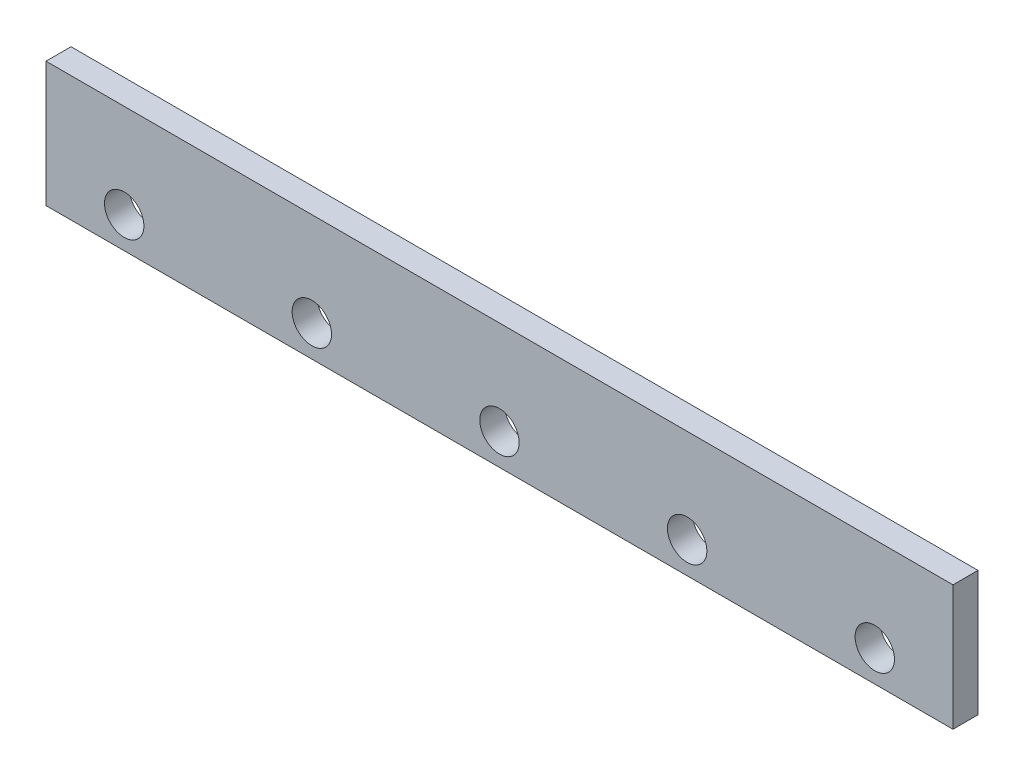
ISO-10303-21;
HEADER;
FILE_DESCRIPTION(('STEP AP214'),'2;1');
FILE_NAME('part.step','',(''),(''),'','','');
FILE_SCHEMA(('AUTOMOTIVE_DESIGN { 1 0 10303 214 1 1 1 1 }'));
ENDSEC;
DATA;
#1=APPLICATION_CONTEXT('core data for automotive mechanical design processes');
#2=APPLICATION_PROTOCOL_DEFINITION('international standard','automotive_design',2000,#1);
#3=PRODUCT_CONTEXT('',#1,'mechanical');
#4=PRODUCT('Part','Part','',(#3));
#5=PRODUCT_RELATED_PRODUCT_CATEGORY('part','',(#4));
#6=PRODUCT_DEFINITION_FORMATION('','',#4);
#7=PRODUCT_DEFINITION_CONTEXT('part definition',#1,'design');
#8=PRODUCT_DEFINITION('design','',#6,#7);
#9=PRODUCT_DEFINITION_SHAPE('','',#8);
#10=(LENGTH_UNIT() NAMED_UNIT(*) SI_UNIT(.MILLI.,.METRE.));
#11=(NAMED_UNIT(*) PLANE_ANGLE_UNIT() SI_UNIT($,.RADIAN.));
#12=(NAMED_UNIT(*) SI_UNIT($,.STERADIAN.) SOLID_ANGLE_UNIT());
#13=UNCERTAINTY_MEASURE_WITH_UNIT(LENGTH_MEASURE(1.E-05),#10,'distance_accuracy_value','');
#14=(GEOMETRIC_REPRESENTATION_CONTEXT(3) GLOBAL_UNCERTAINTY_ASSIGNED_CONTEXT((#13)) GLOBAL_UNIT_ASSIGNED_CONTEXT((#10,
#11,#12)) REPRESENTATION_CONTEXT('',''));
#15=CARTESIAN_POINT('',(0.,0.,0.));
#16=DIRECTION('',(0.,0.,1.));
#17=DIRECTION('',(1.,0.,0.));
#18=AXIS2_PLACEMENT_3D('',#15,#16,#17);
#19=CARTESIAN_POINT('',(290.,-40.,-16.));
#20=DIRECTION('',(1.,0.,0.));
#21=DIRECTION('',(0.,0.,-1.));
#22=AXIS2_PLACEMENT_3D('',#19,#20,#21);
#23=PLANE('',#22);
#24=DIRECTION('',(0.,1.,0.));
#25=VECTOR('',#24,1.);
#26=CARTESIAN_POINT('',(290.,-40.,0.));
#27=LINE('',#26,#25);
#28=CARTESIAN_POINT('',(290.,-40.,0.));
#29=VERTEX_POINT('',#28);
#30=CARTESIAN_POINT('',(290.,40.,0.));
#31=VERTEX_POINT('',#30);
#32=EDGE_CURVE('E98',#29,#31,#27,.T.);
#33=ORIENTED_EDGE('',*,*,#32,.F.);
#34=DIRECTION('',(0.,0.,1.));
#35=VECTOR('',#34,1.);
#36=CARTESIAN_POINT('',(290.,-40.,-16.));
#37=LINE('',#36,#35);
#38=CARTESIAN_POINT('',(290.,-40.,-16.));
#39=VERTEX_POINT('',#38);
#40=EDGE_CURVE('E11',#39,#29,#37,.T.);
#41=ORIENTED_EDGE('',*,*,#40,.F.);
#42=DIRECTION('',(0.,1.,0.));
#43=VECTOR('',#42,1.);
#44=CARTESIAN_POINT('',(290.,-40.,-16.));
#45=LINE('',#44,#43);
#46=CARTESIAN_POINT('',(290.,40.,-16.));
#47=VERTEX_POINT('',#46);
#48=EDGE_CURVE('E91',#39,#47,#45,.T.);
#49=ORIENTED_EDGE('',*,*,#48,.T.);
#50=DIRECTION('',(0.,0.,1.));
#51=VECTOR('',#50,1.);
#52=CARTESIAN_POINT('',(290.,40.,-16.));
#53=LINE('',#52,#51);
#54=EDGE_CURVE('E36',#47,#31,#53,.T.);
#55=ORIENTED_EDGE('',*,*,#54,.T.);
#56=EDGE_LOOP('',(#33,#41,#49,#55));
#57=FACE_BOUND('',#56,.T.);
#58=ADVANCED_FACE('F33',(#57),#23,.T.);
#59=CARTESIAN_POINT('',(-290.,-40.,-16.));
#60=DIRECTION('',(0.,-1.,0.));
#61=DIRECTION('',(0.,0.,-1.));
#62=AXIS2_PLACEMENT_3D('',#59,#60,#61);
#63=PLANE('',#62);
#64=DIRECTION('',(1.,0.,0.));
#65=VECTOR('',#64,1.);
#66=CARTESIAN_POINT('',(-290.,-40.,0.));
#67=LINE('',#66,#65);
#68=CARTESIAN_POINT('',(-290.,-40.,0.));
#69=VERTEX_POINT('',#68);
#70=EDGE_CURVE('E93',#69,#29,#67,.T.);
#71=ORIENTED_EDGE('',*,*,#70,.F.);
#72=DIRECTION('',(0.,0.,1.));
#73=VECTOR('',#72,1.);
#74=CARTESIAN_POINT('',(-290.,-40.,-16.));
#75=LINE('',#74,#73);
#76=CARTESIAN_POINT('',(-290.,-40.,-16.));
#77=VERTEX_POINT('',#76);
#78=EDGE_CURVE('E42',#77,#69,#75,.T.);
#79=ORIENTED_EDGE('',*,*,#78,.F.);
#80=DIRECTION('',(1.,0.,0.));
#81=VECTOR('',#80,1.);
#82=CARTESIAN_POINT('',(-290.,-40.,-16.));
#83=LINE('',#82,#81);
#84=EDGE_CURVE('E88',#77,#39,#83,.T.);
#85=ORIENTED_EDGE('',*,*,#84,.T.);
#86=ORIENTED_EDGE('',*,*,#40,.T.);
#87=EDGE_LOOP('',(#71,#79,#85,#86));
#88=FACE_BOUND('',#87,.T.);
#89=ADVANCED_FACE('F109',(#88),#63,.T.);
#90=CARTESIAN_POINT('',(-290.,-40.,-16.));
#91=DIRECTION('',(-1.,0.,0.));
#92=DIRECTION('',(0.,0.,1.));
#93=AXIS2_PLACEMENT_3D('',#90,#91,#92);
#94=PLANE('',#93);
#95=DIRECTION('',(0.,-1.,0.));
#96=VECTOR('',#95,1.);
#97=CARTESIAN_POINT('',(-290.,-40.,0.));
#98=LINE('',#97,#96);
#99=CARTESIAN_POINT('',(-290.,40.,0.));
#100=VERTEX_POINT('',#99);
#101=EDGE_CURVE('E83',#100,#69,#98,.T.);
#102=ORIENTED_EDGE('',*,*,#101,.F.);
#103=DIRECTION('',(0.,0.,1.));
#104=VECTOR('',#103,1.);
#105=CARTESIAN_POINT('',(-290.,40.,-16.));
#106=LINE('',#105,#104);
#107=CARTESIAN_POINT('',(-290.,40.,-16.));
#108=VERTEX_POINT('',#107);
#109=EDGE_CURVE('E78',#108,#100,#106,.T.);
#110=ORIENTED_EDGE('',*,*,#109,.F.);
#111=DIRECTION('',(0.,-1.,0.));
#112=VECTOR('',#111,1.);
#113=CARTESIAN_POINT('',(-290.,-40.,-16.));
#114=LINE('',#113,#112);
#115=EDGE_CURVE('E81',#108,#77,#114,.T.);
#116=ORIENTED_EDGE('',*,*,#115,.T.);
#117=ORIENTED_EDGE('',*,*,#78,.T.);
#118=EDGE_LOOP('',(#102,#110,#116,#117));
#119=FACE_BOUND('',#118,.T.);
#120=ADVANCED_FACE('F80',(#119),#94,.T.);
#121=CARTESIAN_POINT('',(-290.,40.,-16.));
#122=DIRECTION('',(0.,1.,0.));
#123=DIRECTION('',(0.,0.,1.));
#124=AXIS2_PLACEMENT_3D('',#121,#122,#123);
#125=PLANE('',#124);
#126=DIRECTION('',(-1.,0.,0.));
#127=VECTOR('',#126,1.);
#128=CARTESIAN_POINT('',(-290.,40.,0.));
#129=LINE('',#128,#127);
#130=EDGE_CURVE('E101',#31,#100,#129,.T.);
#131=ORIENTED_EDGE('',*,*,#130,.F.);
#132=ORIENTED_EDGE('',*,*,#54,.F.);
#133=DIRECTION('',(-1.,0.,0.));
#134=VECTOR('',#133,1.);
#135=CARTESIAN_POINT('',(-290.,40.,-16.));
#136=LINE('',#135,#134);
#137=EDGE_CURVE('E87',#47,#108,#136,.T.);
#138=ORIENTED_EDGE('',*,*,#137,.T.);
#139=ORIENTED_EDGE('',*,*,#109,.T.);
#140=EDGE_LOOP('',(#131,#132,#138,#139));
#141=FACE_BOUND('',#140,.T.);
#142=ADVANCED_FACE('F90',(#141),#125,.T.);
#143=CARTESIAN_POINT('',(0.,0.,-16.));
#144=DIRECTION('',(0.,0.,-1.));
#145=DIRECTION('',(-1.,0.,0.));
#146=AXIS2_PLACEMENT_3D('',#143,#144,#145);
#147=PLANE('',#146);
#148=CARTESIAN_POINT('',(240.,-20.,-16.));
#149=DIRECTION('',(0.,0.,1.));
#150=DIRECTION('',(1.,0.,0.));
#151=AXIS2_PLACEMENT_3D('',#148,#149,#150);
#152=CIRCLE('',#151,12.6);
#153=CARTESIAN_POINT('',(252.6,-20.,-16.));
#154=VERTEX_POINT('',#153);
#155=EDGE_CURVE('E154',#154,#154,#152,.T.);
#156=ORIENTED_EDGE('',*,*,#155,.T.);
#157=EDGE_LOOP('',(#156));
#158=FACE_BOUND('',#157,.T.);
#159=CARTESIAN_POINT('',(120.,-20.,-16.));
#160=DIRECTION('',(0.,0.,1.));
#161=DIRECTION('',(1.,0.,0.));
#162=AXIS2_PLACEMENT_3D('',#159,#160,#161);
#163=CIRCLE('',#162,12.6);
#164=CARTESIAN_POINT('',(132.6,-20.,-16.));
#165=VERTEX_POINT('',#164);
#166=EDGE_CURVE('E162',#165,#165,#163,.T.);
#167=ORIENTED_EDGE('',*,*,#166,.T.);
#168=EDGE_LOOP('',(#167));
#169=FACE_BOUND('',#168,.T.);
#170=CARTESIAN_POINT('',(0.,-20.,-16.));
#171=DIRECTION('',(0.,0.,1.));
#172=DIRECTION('',(1.,0.,0.));
#173=AXIS2_PLACEMENT_3D('',#170,#171,#172);
#174=CIRCLE('',#173,12.6);
#175=CARTESIAN_POINT('',(12.6,-20.,-16.));
#176=VERTEX_POINT('',#175);
#177=EDGE_CURVE('E168',#176,#176,#174,.T.);
#178=ORIENTED_EDGE('',*,*,#177,.T.);
#179=EDGE_LOOP('',(#178));
#180=FACE_BOUND('',#179,.T.);
#181=CARTESIAN_POINT('',(-120.,-20.,-16.));
#182=DIRECTION('',(0.,0.,1.));
#183=DIRECTION('',(1.,0.,0.));
#184=AXIS2_PLACEMENT_3D('',#181,#182,#183);
#185=CIRCLE('',#184,12.6);
#186=CARTESIAN_POINT('',(-107.4,-20.,-16.));
#187=VERTEX_POINT('',#186);
#188=EDGE_CURVE('E174',#187,#187,#185,.T.);
#189=ORIENTED_EDGE('',*,*,#188,.T.);
#190=EDGE_LOOP('',(#189));
#191=FACE_BOUND('',#190,.T.);
#192=CARTESIAN_POINT('',(-240.,-20.,-16.));
#193=DIRECTION('',(0.,0.,1.));
#194=DIRECTION('',(1.,0.,0.));
#195=AXIS2_PLACEMENT_3D('',#192,#193,#194);
#196=CIRCLE('',#195,12.6);
#197=CARTESIAN_POINT('',(-227.4,-20.,-16.));
#198=VERTEX_POINT('',#197);
#199=EDGE_CURVE('E102',#198,#198,#196,.T.);
#200=ORIENTED_EDGE('',*,*,#199,.T.);
#201=EDGE_LOOP('',(#200));
#202=FACE_BOUND('',#201,.T.);
#203=ORIENTED_EDGE('',*,*,#48,.F.);
#204=ORIENTED_EDGE('',*,*,#84,.F.);
#205=ORIENTED_EDGE('',*,*,#115,.F.);
#206=ORIENTED_EDGE('',*,*,#137,.F.);
#207=EDGE_LOOP('',(#203,#204,#205,#206));
#208=FACE_BOUND('',#207,.T.);
#209=ADVANCED_FACE('F86',(#158,#169,#180,#191,#202,#208),#147,.T.);
#210=CARTESIAN_POINT('',(0.,0.,0.));
#211=DIRECTION('',(0.,0.,-1.));
#212=DIRECTION('',(-1.,0.,0.));
#213=AXIS2_PLACEMENT_3D('',#210,#211,#212);
#214=PLANE('',#213);
#215=CARTESIAN_POINT('',(240.,-20.,0.));
#216=DIRECTION('',(0.,0.,1.));
#217=DIRECTION('',(1.,0.,0.));
#218=AXIS2_PLACEMENT_3D('',#215,#216,#217);
#219=CIRCLE('',#218,12.6);
#220=CARTESIAN_POINT('',(252.6,-20.,0.));
#221=VERTEX_POINT('',#220);
#222=EDGE_CURVE('E157',#221,#221,#219,.T.);
#223=ORIENTED_EDGE('',*,*,#222,.F.);
#224=EDGE_LOOP('',(#223));
#225=FACE_BOUND('',#224,.T.);
#226=CARTESIAN_POINT('',(120.,-20.,0.));
#227=DIRECTION('',(0.,0.,1.));
#228=DIRECTION('',(1.,0.,0.));
#229=AXIS2_PLACEMENT_3D('',#226,#227,#228);
#230=CIRCLE('',#229,12.6);
#231=CARTESIAN_POINT('',(132.6,-20.,0.));
#232=VERTEX_POINT('',#231);
#233=EDGE_CURVE('E159',#232,#232,#230,.T.);
#234=ORIENTED_EDGE('',*,*,#233,.F.);
#235=EDGE_LOOP('',(#234));
#236=FACE_BOUND('',#235,.T.);
#237=CARTESIAN_POINT('',(0.,-20.,0.));
#238=DIRECTION('',(0.,0.,1.));
#239=DIRECTION('',(1.,0.,0.));
#240=AXIS2_PLACEMENT_3D('',#237,#238,#239);
#241=CIRCLE('',#240,12.6);
#242=CARTESIAN_POINT('',(12.6,-20.,0.));
#243=VERTEX_POINT('',#242);
#244=EDGE_CURVE('E165',#243,#243,#241,.T.);
#245=ORIENTED_EDGE('',*,*,#244,.F.);
#246=EDGE_LOOP('',(#245));
#247=FACE_BOUND('',#246,.T.);
#248=CARTESIAN_POINT('',(-120.,-20.,0.));
#249=DIRECTION('',(0.,0.,1.));
#250=DIRECTION('',(1.,0.,0.));
#251=AXIS2_PLACEMENT_3D('',#248,#249,#250);
#252=CIRCLE('',#251,12.6);
#253=CARTESIAN_POINT('',(-107.4,-20.,0.));
#254=VERTEX_POINT('',#253);
#255=EDGE_CURVE('E171',#254,#254,#252,.T.);
#256=ORIENTED_EDGE('',*,*,#255,.F.);
#257=EDGE_LOOP('',(#256));
#258=FACE_BOUND('',#257,.T.);
#259=CARTESIAN_POINT('',(-240.,-20.,0.));
#260=DIRECTION('',(0.,0.,1.));
#261=DIRECTION('',(1.,0.,0.));
#262=AXIS2_PLACEMENT_3D('',#259,#260,#261);
#263=CIRCLE('',#262,12.6);
#264=CARTESIAN_POINT('',(-227.4,-20.,0.));
#265=VERTEX_POINT('',#264);
#266=EDGE_CURVE('E177',#265,#265,#263,.T.);
#267=ORIENTED_EDGE('',*,*,#266,.F.);
#268=EDGE_LOOP('',(#267));
#269=FACE_BOUND('',#268,.T.);
#270=ORIENTED_EDGE('',*,*,#32,.T.);
#271=ORIENTED_EDGE('',*,*,#130,.T.);
#272=ORIENTED_EDGE('',*,*,#101,.T.);
#273=ORIENTED_EDGE('',*,*,#70,.T.);
#274=EDGE_LOOP('',(#270,#271,#272,#273));
#275=FACE_BOUND('',#274,.T.);
#276=ADVANCED_FACE('F108',(#225,#236,#247,#258,#269,#275),#214,.F.);
#277=CARTESIAN_POINT('',(-240.,-20.,-16.));
#278=DIRECTION('',(0.,0.,1.));
#279=DIRECTION('',(1.,0.,0.));
#280=AXIS2_PLACEMENT_3D('',#277,#278,#279);
#281=CYLINDRICAL_SURFACE('',#280,12.6);
#282=ORIENTED_EDGE('',*,*,#199,.F.);
#283=EDGE_LOOP('',(#282));
#284=FACE_BOUND('',#283,.T.);
#285=ORIENTED_EDGE('',*,*,#266,.T.);
#286=EDGE_LOOP('',(#285));
#287=FACE_BOUND('',#286,.T.);
#288=ADVANCED_FACE('F127',(#284,#287),#281,.F.);
#289=CARTESIAN_POINT('',(-120.,-20.,-16.));
#290=DIRECTION('',(0.,0.,1.));
#291=DIRECTION('',(1.,0.,0.));
#292=AXIS2_PLACEMENT_3D('',#289,#290,#291);
#293=CYLINDRICAL_SURFACE('',#292,12.6);
#294=ORIENTED_EDGE('',*,*,#188,.F.);
#295=EDGE_LOOP('',(#294));
#296=FACE_BOUND('',#295,.T.);
#297=ORIENTED_EDGE('',*,*,#255,.T.);
#298=EDGE_LOOP('',(#297));
#299=FACE_BOUND('',#298,.T.);
#300=ADVANCED_FACE('F134',(#296,#299),#293,.F.);
#301=CARTESIAN_POINT('',(0.,-20.,-16.));
#302=DIRECTION('',(0.,0.,1.));
#303=DIRECTION('',(1.,0.,0.));
#304=AXIS2_PLACEMENT_3D('',#301,#302,#303);
#305=CYLINDRICAL_SURFACE('',#304,12.6);
#306=ORIENTED_EDGE('',*,*,#177,.F.);
#307=EDGE_LOOP('',(#306));
#308=FACE_BOUND('',#307,.T.);
#309=ORIENTED_EDGE('',*,*,#244,.T.);
#310=EDGE_LOOP('',(#309));
#311=FACE_BOUND('',#310,.T.);
#312=ADVANCED_FACE('F138',(#308,#311),#305,.F.);
#313=CARTESIAN_POINT('',(120.,-20.,-16.));
#314=DIRECTION('',(0.,0.,1.));
#315=DIRECTION('',(1.,0.,0.));
#316=AXIS2_PLACEMENT_3D('',#313,#314,#315);
#317=CYLINDRICAL_SURFACE('',#316,12.6);
#318=ORIENTED_EDGE('',*,*,#166,.F.);
#319=EDGE_LOOP('',(#318));
#320=FACE_BOUND('',#319,.T.);
#321=ORIENTED_EDGE('',*,*,#233,.T.);
#322=EDGE_LOOP('',(#321));
#323=FACE_BOUND('',#322,.T.);
#324=ADVANCED_FACE('F142',(#320,#323),#317,.F.);
#325=CARTESIAN_POINT('',(240.,-20.,-16.));
#326=DIRECTION('',(0.,0.,1.));
#327=DIRECTION('',(1.,0.,0.));
#328=AXIS2_PLACEMENT_3D('',#325,#326,#327);
#329=CYLINDRICAL_SURFACE('',#328,12.6);
#330=ORIENTED_EDGE('',*,*,#155,.F.);
#331=EDGE_LOOP('',(#330));
#332=FACE_BOUND('',#331,.T.);
#333=ORIENTED_EDGE('',*,*,#222,.T.);
#334=EDGE_LOOP('',(#333));
#335=FACE_BOUND('',#334,.T.);
#336=ADVANCED_FACE('F146',(#332,#335),#329,.F.);
#337=CLOSED_SHELL('',(#58,#89,#120,#142,#209,#276,#288,#300,#312,#324,#336));
#338=MANIFOLD_SOLID_BREP('B2',#337);
#339=ADVANCED_BREP_SHAPE_REPRESENTATION('',(#18,#338),#14);
#340=SHAPE_DEFINITION_REPRESENTATION(#9,#339);
ENDSEC;
END-ISO-10303-21;
